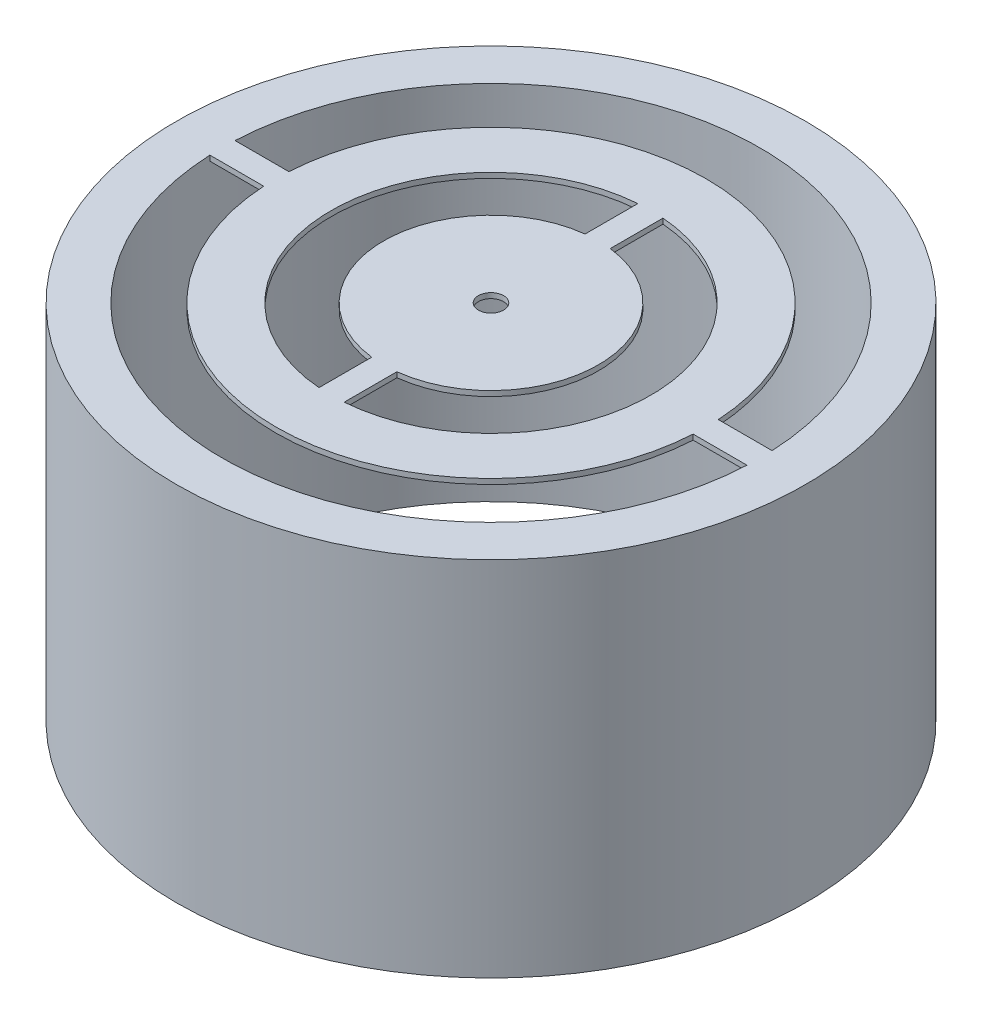
ISO-10303-21;
HEADER;
FILE_DESCRIPTION(('STEP AP214'),'2;1');
FILE_NAME('part.step','',(''),(''),'','','');
FILE_SCHEMA(('AUTOMOTIVE_DESIGN { 1 0 10303 214 1 1 1 1 }'));
ENDSEC;
DATA;
#1=APPLICATION_CONTEXT('core data for automotive mechanical design processes');
#2=APPLICATION_PROTOCOL_DEFINITION('international standard','automotive_design',2000,#1);
#3=PRODUCT_CONTEXT('',#1,'mechanical');
#4=PRODUCT('Part','Part','',(#3));
#5=PRODUCT_RELATED_PRODUCT_CATEGORY('part','',(#4));
#6=PRODUCT_DEFINITION_FORMATION('','',#4);
#7=PRODUCT_DEFINITION_CONTEXT('part definition',#1,'design');
#8=PRODUCT_DEFINITION('design','',#6,#7);
#9=PRODUCT_DEFINITION_SHAPE('','',#8);
#10=(LENGTH_UNIT() NAMED_UNIT(*) SI_UNIT(.MILLI.,.METRE.));
#11=(NAMED_UNIT(*) PLANE_ANGLE_UNIT() SI_UNIT($,.RADIAN.));
#12=(NAMED_UNIT(*) SI_UNIT($,.STERADIAN.) SOLID_ANGLE_UNIT());
#13=UNCERTAINTY_MEASURE_WITH_UNIT(LENGTH_MEASURE(1.E-05),#10,'distance_accuracy_value','');
#14=(GEOMETRIC_REPRESENTATION_CONTEXT(3) GLOBAL_UNCERTAINTY_ASSIGNED_CONTEXT((#13)) GLOBAL_UNIT_ASSIGNED_CONTEXT((#10,
#11,#12)) REPRESENTATION_CONTEXT('',''));
#15=CARTESIAN_POINT('',(0.,0.,0.));
#16=DIRECTION('',(0.,0.,1.));
#17=DIRECTION('',(1.,0.,0.));
#18=AXIS2_PLACEMENT_3D('',#15,#16,#17);
#19=CARTESIAN_POINT('',(0.,0.,0.));
#20=DIRECTION('',(0.,1.,0.));
#21=DIRECTION('',(0.,0.,1.));
#22=AXIS2_PLACEMENT_3D('',#19,#20,#21);
#23=PLANE('',#22);
#24=CARTESIAN_POINT('',(0.,0.,0.));
#25=DIRECTION('',(0.,1.,0.));
#26=DIRECTION('',(0.,0.,-1.));
#27=AXIS2_PLACEMENT_3D('',#24,#25,#26);
#28=CIRCLE('',#27,7.62386056946014);
#29=CARTESIAN_POINT('',(0.6,0.,7.60021381163511));
#30=VERTEX_POINT('',#29);
#31=CARTESIAN_POINT('',(0.6,0.,-7.60021381163511));
#32=VERTEX_POINT('',#31);
#33=EDGE_CURVE('E56',#30,#32,#28,.T.);
#34=ORIENTED_EDGE('',*,*,#33,.T.);
#35=DIRECTION('',(0.,0.,1.));
#36=VECTOR('',#35,1.);
#37=CARTESIAN_POINT('',(0.6,0.,-5.08496078060006));
#38=LINE('',#37,#36);
#39=CARTESIAN_POINT('',(0.6,0.,-5.08496078060006));
#40=VERTEX_POINT('',#39);
#41=EDGE_CURVE('E180',#32,#40,#38,.T.);
#42=ORIENTED_EDGE('',*,*,#41,.T.);
#43=CARTESIAN_POINT('',(0.,0.,0.));
#44=DIRECTION('',(0.,-1.,0.));
#45=DIRECTION('',(0.,0.,-1.));
#46=AXIS2_PLACEMENT_3D('',#43,#44,#45);
#47=CIRCLE('',#46,5.12023692227623);
#48=CARTESIAN_POINT('',(0.6,0.,5.08496078060006));
#49=VERTEX_POINT('',#48);
#50=EDGE_CURVE('E199',#40,#49,#47,.T.);
#51=ORIENTED_EDGE('',*,*,#50,.T.);
#52=DIRECTION('',(0.,0.,1.));
#53=VECTOR('',#52,1.);
#54=CARTESIAN_POINT('',(0.6,0.,5.08496078060006));
#55=LINE('',#54,#53);
#56=EDGE_CURVE('E190',#49,#30,#55,.T.);
#57=ORIENTED_EDGE('',*,*,#56,.T.);
#58=EDGE_LOOP('',(#34,#42,#51,#57));
#59=FACE_BOUND('',#58,.T.);
#60=CARTESIAN_POINT('',(0.,0.,0.));
#61=DIRECTION('',(0.,1.,0.));
#62=DIRECTION('',(0.,0.,1.));
#63=AXIS2_PLACEMENT_3D('',#60,#61,#62);
#64=CIRCLE('',#63,7.62386056946014);
#65=CARTESIAN_POINT('',(-0.6,0.,-7.60021381163511));
#66=VERTEX_POINT('',#65);
#67=CARTESIAN_POINT('',(-0.6,0.,7.60021381163511));
#68=VERTEX_POINT('',#67);
#69=EDGE_CURVE('E252',#66,#68,#64,.T.);
#70=ORIENTED_EDGE('',*,*,#69,.T.);
#71=DIRECTION('',(0.,0.,-1.));
#72=VECTOR('',#71,1.);
#73=CARTESIAN_POINT('',(-0.6,0.,7.60021381163511));
#74=LINE('',#73,#72);
#75=CARTESIAN_POINT('',(-0.6,0.,5.08496078060006));
#76=VERTEX_POINT('',#75);
#77=EDGE_CURVE('E268',#68,#76,#74,.T.);
#78=ORIENTED_EDGE('',*,*,#77,.T.);
#79=CARTESIAN_POINT('',(0.,0.,0.));
#80=DIRECTION('',(0.,-1.,0.));
#81=DIRECTION('',(0.,0.,1.));
#82=AXIS2_PLACEMENT_3D('',#79,#80,#81);
#83=CIRCLE('',#82,5.12023692227623);
#84=CARTESIAN_POINT('',(-0.6,0.,-5.08496078060006));
#85=VERTEX_POINT('',#84);
#86=EDGE_CURVE('E271',#76,#85,#83,.T.);
#87=ORIENTED_EDGE('',*,*,#86,.T.);
#88=DIRECTION('',(0.,0.,-1.));
#89=VECTOR('',#88,1.);
#90=CARTESIAN_POINT('',(-0.6,0.,-7.60021381163511));
#91=LINE('',#90,#89);
#92=EDGE_CURVE('E258',#85,#66,#91,.T.);
#93=ORIENTED_EDGE('',*,*,#92,.T.);
#94=EDGE_LOOP('',(#70,#78,#87,#93));
#95=FACE_BOUND('',#94,.T.);
#96=CARTESIAN_POINT('',(0.,0.,0.));
#97=DIRECTION('',(0.,1.,0.));
#98=DIRECTION('',(0.,0.,1.));
#99=AXIS2_PLACEMENT_3D('',#96,#97,#98);
#100=CIRCLE('',#99,0.6);
#101=CARTESIAN_POINT('',(0.,0.,0.6));
#102=VERTEX_POINT('',#101);
#103=EDGE_CURVE('E248',#102,#102,#100,.T.);
#104=ORIENTED_EDGE('',*,*,#103,.T.);
#105=EDGE_LOOP('',(#104));
#106=FACE_BOUND('',#105,.T.);
#107=CARTESIAN_POINT('',(0.,0.,0.));
#108=DIRECTION('',(0.,1.,0.));
#109=DIRECTION('',(0.,0.,1.));
#110=AXIS2_PLACEMENT_3D('',#107,#108,#109);
#111=CIRCLE('',#110,12.8157373427537);
#112=CARTESIAN_POINT('',(12.8016844062979,0.,0.6));
#113=VERTEX_POINT('',#112);
#114=CARTESIAN_POINT('',(12.8016844062979,0.,-0.6));
#115=VERTEX_POINT('',#114);
#116=EDGE_CURVE('E167',#113,#115,#111,.T.);
#117=ORIENTED_EDGE('',*,*,#116,.F.);
#118=DIRECTION('',(-1.,0.,0.));
#119=VECTOR('',#118,1.);
#120=CARTESIAN_POINT('',(10.2351825917073,0.,0.6));
#121=LINE('',#120,#119);
#122=CARTESIAN_POINT('',(10.2351825917073,0.,0.6));
#123=VERTEX_POINT('',#122);
#124=EDGE_CURVE('E148',#113,#123,#121,.T.);
#125=ORIENTED_EDGE('',*,*,#124,.T.);
#126=CARTESIAN_POINT('',(0.,0.,0.));
#127=DIRECTION('',(0.,-1.,0.));
#128=DIRECTION('',(0.,0.,1.));
#129=AXIS2_PLACEMENT_3D('',#126,#127,#128);
#130=CIRCLE('',#129,10.2527539073943);
#131=CARTESIAN_POINT('',(-10.2351825917073,0.,0.6));
#132=VERTEX_POINT('',#131);
#133=EDGE_CURVE('E210',#123,#132,#130,.T.);
#134=ORIENTED_EDGE('',*,*,#133,.T.);
#135=DIRECTION('',(-1.,0.,0.));
#136=VECTOR('',#135,1.);
#137=CARTESIAN_POINT('',(-12.8016844062979,0.,0.6));
#138=LINE('',#137,#136);
#139=CARTESIAN_POINT('',(-12.8016844062979,0.,0.6));
#140=VERTEX_POINT('',#139);
#141=EDGE_CURVE('E159',#132,#140,#138,.T.);
#142=ORIENTED_EDGE('',*,*,#141,.T.);
#143=CARTESIAN_POINT('',(-12.8016844062979,0.,-0.6));
#144=VERTEX_POINT('',#143);
#145=EDGE_CURVE('E178',#144,#140,#111,.T.);
#146=ORIENTED_EDGE('',*,*,#145,.F.);
#147=DIRECTION('',(1.,0.,0.));
#148=VECTOR('',#147,1.);
#149=CARTESIAN_POINT('',(-12.8016844062979,0.,-0.6));
#150=LINE('',#149,#148);
#151=CARTESIAN_POINT('',(-10.2351825917073,0.,-0.599999999999996));
#152=VERTEX_POINT('',#151);
#153=EDGE_CURVE('E225',#144,#152,#150,.T.);
#154=ORIENTED_EDGE('',*,*,#153,.T.);
#155=CARTESIAN_POINT('',(0.,0.,0.));
#156=DIRECTION('',(0.,-1.,0.));
#157=DIRECTION('',(0.,0.,-1.));
#158=AXIS2_PLACEMENT_3D('',#155,#156,#157);
#159=CIRCLE('',#158,10.2527539073943);
#160=CARTESIAN_POINT('',(10.2351825917073,0.,-0.6));
#161=VERTEX_POINT('',#160);
#162=EDGE_CURVE('E238',#152,#161,#159,.T.);
#163=ORIENTED_EDGE('',*,*,#162,.T.);
#164=DIRECTION('',(1.,0.,0.));
#165=VECTOR('',#164,1.);
#166=CARTESIAN_POINT('',(10.2351825917073,0.,-0.6));
#167=LINE('',#166,#165);
#168=EDGE_CURVE('E177',#161,#115,#167,.T.);
#169=ORIENTED_EDGE('',*,*,#168,.T.);
#170=EDGE_LOOP('',(#117,#125,#134,#142,#146,#154,#163,#169));
#171=FACE_BOUND('',#170,.T.);
#172=ADVANCED_FACE('F33',(#59,#95,#106,#171),#23,.F.);
#173=CARTESIAN_POINT('',(0.,0.25,0.));
#174=DIRECTION('',(0.,1.,0.));
#175=DIRECTION('',(0.,0.,1.));
#176=AXIS2_PLACEMENT_3D('',#173,#174,#175);
#177=PLANE('',#176);
#178=CARTESIAN_POINT('',(0.,0.25,0.));
#179=DIRECTION('',(0.,1.,0.));
#180=DIRECTION('',(0.,0.,-1.));
#181=AXIS2_PLACEMENT_3D('',#178,#179,#180);
#182=CIRCLE('',#181,12.8157373427537);
#183=CARTESIAN_POINT('',(12.8016844062979,0.25,-0.6));
#184=VERTEX_POINT('',#183);
#185=CARTESIAN_POINT('',(-12.8016844062979,0.25,-0.6));
#186=VERTEX_POINT('',#185);
#187=EDGE_CURVE('E226',#184,#186,#182,.T.);
#188=ORIENTED_EDGE('',*,*,#187,.F.);
#189=DIRECTION('',(1.,0.,0.));
#190=VECTOR('',#189,1.);
#191=CARTESIAN_POINT('',(10.2351825917073,0.25,-0.6));
#192=LINE('',#191,#190);
#193=CARTESIAN_POINT('',(10.2351825917073,0.25,-0.6));
#194=VERTEX_POINT('',#193);
#195=EDGE_CURVE('E233',#194,#184,#192,.T.);
#196=ORIENTED_EDGE('',*,*,#195,.F.);
#197=CARTESIAN_POINT('',(0.,0.25,0.));
#198=DIRECTION('',(0.,-1.,0.));
#199=DIRECTION('',(0.,0.,-1.));
#200=AXIS2_PLACEMENT_3D('',#197,#198,#199);
#201=CIRCLE('',#200,10.2527539073943);
#202=CARTESIAN_POINT('',(-10.2351825917073,0.25,-0.599999999999996));
#203=VERTEX_POINT('',#202);
#204=EDGE_CURVE('E230',#203,#194,#201,.T.);
#205=ORIENTED_EDGE('',*,*,#204,.F.);
#206=DIRECTION('',(1.,0.,0.));
#207=VECTOR('',#206,1.);
#208=CARTESIAN_POINT('',(-12.8016844062979,0.25,-0.6));
#209=LINE('',#208,#207);
#210=EDGE_CURVE('E228',#186,#203,#209,.T.);
#211=ORIENTED_EDGE('',*,*,#210,.F.);
#212=EDGE_LOOP('',(#188,#196,#205,#211));
#213=FACE_BOUND('',#212,.T.);
#214=DIRECTION('',(-1.,0.,0.));
#215=VECTOR('',#214,1.);
#216=CARTESIAN_POINT('',(10.2351825917073,0.25,0.6));
#217=LINE('',#216,#215);
#218=CARTESIAN_POINT('',(12.8016844062979,0.25,0.6));
#219=VERTEX_POINT('',#218);
#220=CARTESIAN_POINT('',(10.2351825917073,0.25,0.6));
#221=VERTEX_POINT('',#220);
#222=EDGE_CURVE('E215',#219,#221,#217,.T.);
#223=ORIENTED_EDGE('',*,*,#222,.F.);
#224=CARTESIAN_POINT('',(0.,0.25,0.));
#225=DIRECTION('',(0.,1.,0.));
#226=DIRECTION('',(0.,0.,1.));
#227=AXIS2_PLACEMENT_3D('',#224,#225,#226);
#228=CIRCLE('',#227,12.8157373427537);
#229=CARTESIAN_POINT('',(-12.8016844062979,0.25,0.6));
#230=VERTEX_POINT('',#229);
#231=EDGE_CURVE('E170',#230,#219,#228,.T.);
#232=ORIENTED_EDGE('',*,*,#231,.F.);
#233=DIRECTION('',(-1.,0.,0.));
#234=VECTOR('',#233,1.);
#235=CARTESIAN_POINT('',(-12.8016844062979,0.25,0.6));
#236=LINE('',#235,#234);
#237=CARTESIAN_POINT('',(-10.2351825917073,0.25,0.6));
#238=VERTEX_POINT('',#237);
#239=EDGE_CURVE('E212',#238,#230,#236,.T.);
#240=ORIENTED_EDGE('',*,*,#239,.F.);
#241=CARTESIAN_POINT('',(0.,0.25,0.));
#242=DIRECTION('',(0.,-1.,0.));
#243=DIRECTION('',(0.,0.,1.));
#244=AXIS2_PLACEMENT_3D('',#241,#242,#243);
#245=CIRCLE('',#244,10.2527539073943);
#246=EDGE_CURVE('E158',#221,#238,#245,.T.);
#247=ORIENTED_EDGE('',*,*,#246,.F.);
#248=EDGE_LOOP('',(#223,#232,#240,#247));
#249=FACE_BOUND('',#248,.T.);
#250=CARTESIAN_POINT('',(0.,0.25,0.));
#251=DIRECTION('',(0.,1.,0.));
#252=DIRECTION('',(0.,0.,1.));
#253=AXIS2_PLACEMENT_3D('',#250,#251,#252);
#254=CIRCLE('',#253,15.);
#255=CARTESIAN_POINT('',(0.,0.25,15.));
#256=VERTEX_POINT('',#255);
#257=EDGE_CURVE('E11',#256,#256,#254,.T.);
#258=ORIENTED_EDGE('',*,*,#257,.T.);
#259=EDGE_LOOP('',(#258));
#260=FACE_BOUND('',#259,.T.);
#261=DIRECTION('',(0.,0.,1.));
#262=VECTOR('',#261,1.);
#263=CARTESIAN_POINT('',(0.6,0.25,-5.08496078060006));
#264=LINE('',#263,#262);
#265=CARTESIAN_POINT('',(0.6,0.25,-7.60021381163511));
#266=VERTEX_POINT('',#265);
#267=CARTESIAN_POINT('',(0.6,0.25,-5.08496078060006));
#268=VERTEX_POINT('',#267);
#269=EDGE_CURVE('E189',#266,#268,#264,.T.);
#270=ORIENTED_EDGE('',*,*,#269,.F.);
#271=CARTESIAN_POINT('',(0.,0.25,0.));
#272=DIRECTION('',(0.,1.,0.));
#273=DIRECTION('',(0.,0.,-1.));
#274=AXIS2_PLACEMENT_3D('',#271,#272,#273);
#275=CIRCLE('',#274,7.62386056946014);
#276=CARTESIAN_POINT('',(0.6,0.25,7.60021381163511));
#277=VERTEX_POINT('',#276);
#278=EDGE_CURVE('E187',#277,#266,#275,.T.);
#279=ORIENTED_EDGE('',*,*,#278,.F.);
#280=DIRECTION('',(0.,0.,1.));
#281=VECTOR('',#280,1.);
#282=CARTESIAN_POINT('',(0.6,0.25,5.08496078060006));
#283=LINE('',#282,#281);
#284=CARTESIAN_POINT('',(0.6,0.25,5.08496078060006));
#285=VERTEX_POINT('',#284);
#286=EDGE_CURVE('E194',#285,#277,#283,.T.);
#287=ORIENTED_EDGE('',*,*,#286,.F.);
#288=CARTESIAN_POINT('',(0.,0.25,0.));
#289=DIRECTION('',(0.,-1.,0.));
#290=DIRECTION('',(0.,0.,-1.));
#291=AXIS2_PLACEMENT_3D('',#288,#289,#290);
#292=CIRCLE('',#291,5.12023692227623);
#293=EDGE_CURVE('E192',#268,#285,#292,.T.);
#294=ORIENTED_EDGE('',*,*,#293,.F.);
#295=EDGE_LOOP('',(#270,#279,#287,#294));
#296=FACE_BOUND('',#295,.T.);
#297=CARTESIAN_POINT('',(0.,0.25,0.));
#298=DIRECTION('',(0.,1.,0.));
#299=DIRECTION('',(0.,0.,1.));
#300=AXIS2_PLACEMENT_3D('',#297,#298,#299);
#301=CIRCLE('',#300,0.6);
#302=CARTESIAN_POINT('',(0.,0.25,0.6));
#303=VERTEX_POINT('',#302);
#304=EDGE_CURVE('E249',#303,#303,#301,.T.);
#305=ORIENTED_EDGE('',*,*,#304,.F.);
#306=EDGE_LOOP('',(#305));
#307=FACE_BOUND('',#306,.T.);
#308=DIRECTION('',(0.,0.,-1.));
#309=VECTOR('',#308,1.);
#310=CARTESIAN_POINT('',(-0.6,0.25,7.60021381163511));
#311=LINE('',#310,#309);
#312=CARTESIAN_POINT('',(-0.6,0.25,7.60021381163511));
#313=VERTEX_POINT('',#312);
#314=CARTESIAN_POINT('',(-0.6,0.25,5.08496078060006));
#315=VERTEX_POINT('',#314);
#316=EDGE_CURVE('E257',#313,#315,#311,.T.);
#317=ORIENTED_EDGE('',*,*,#316,.F.);
#318=CARTESIAN_POINT('',(0.,0.25,0.));
#319=DIRECTION('',(0.,1.,0.));
#320=DIRECTION('',(0.,0.,1.));
#321=AXIS2_PLACEMENT_3D('',#318,#319,#320);
#322=CIRCLE('',#321,7.62386056946014);
#323=CARTESIAN_POINT('',(-0.6,0.25,-7.60021381163511));
#324=VERTEX_POINT('',#323);
#325=EDGE_CURVE('E255',#324,#313,#322,.T.);
#326=ORIENTED_EDGE('',*,*,#325,.F.);
#327=DIRECTION('',(0.,0.,-1.));
#328=VECTOR('',#327,1.);
#329=CARTESIAN_POINT('',(-0.6,0.25,-7.60021381163511));
#330=LINE('',#329,#328);
#331=CARTESIAN_POINT('',(-0.6,0.25,-5.08496078060006));
#332=VERTEX_POINT('',#331);
#333=EDGE_CURVE('E263',#332,#324,#330,.T.);
#334=ORIENTED_EDGE('',*,*,#333,.F.);
#335=CARTESIAN_POINT('',(0.,0.25,0.));
#336=DIRECTION('',(0.,-1.,0.));
#337=DIRECTION('',(0.,0.,1.));
#338=AXIS2_PLACEMENT_3D('',#335,#336,#337);
#339=CIRCLE('',#338,5.12023692227623);
#340=EDGE_CURVE('E260',#315,#332,#339,.T.);
#341=ORIENTED_EDGE('',*,*,#340,.F.);
#342=EDGE_LOOP('',(#317,#326,#334,#341));
#343=FACE_BOUND('',#342,.T.);
#344=ADVANCED_FACE('F297',(#213,#249,#260,#296,#307,#343),#177,.T.);
#345=CARTESIAN_POINT('',(0.,0.25,0.));
#346=DIRECTION('',(0.,-1.,0.));
#347=DIRECTION('',(0.,0.,-1.));
#348=AXIS2_PLACEMENT_3D('',#345,#346,#347);
#349=CYLINDRICAL_SURFACE('',#348,15.);
#350=ORIENTED_EDGE('',*,*,#257,.F.);
#351=EDGE_LOOP('',(#350));
#352=FACE_BOUND('',#351,.T.);
#353=CARTESIAN_POINT('',(0.,-17.018,0.));
#354=DIRECTION('',(0.,1.,0.));
#355=DIRECTION('',(0.,0.,1.));
#356=AXIS2_PLACEMENT_3D('',#353,#354,#355);
#357=CIRCLE('',#356,15.);
#358=CARTESIAN_POINT('',(0.,-17.018,15.));
#359=VERTEX_POINT('',#358);
#360=EDGE_CURVE('E183',#359,#359,#357,.T.);
#361=ORIENTED_EDGE('',*,*,#360,.T.);
#362=EDGE_LOOP('',(#361));
#363=FACE_BOUND('',#362,.T.);
#364=ADVANCED_FACE('F35',(#352,#363),#349,.T.);
#365=CARTESIAN_POINT('',(0.,0.25,0.));
#366=DIRECTION('',(0.,-1.,0.));
#367=DIRECTION('',(0.,0.,-1.));
#368=AXIS2_PLACEMENT_3D('',#365,#366,#367);
#369=CYLINDRICAL_SURFACE('',#368,7.62386056946014);
#370=ORIENTED_EDGE('',*,*,#69,.F.);
#371=DIRECTION('',(0.,-1.,0.));
#372=VECTOR('',#371,1.);
#373=CARTESIAN_POINT('',(-0.6,0.25,-7.60021381163511));
#374=LINE('',#373,#372);
#375=EDGE_CURVE('E265',#324,#66,#374,.T.);
#376=ORIENTED_EDGE('',*,*,#375,.F.);
#377=ORIENTED_EDGE('',*,*,#325,.T.);
#378=DIRECTION('',(0.,-1.,0.));
#379=VECTOR('',#378,1.);
#380=CARTESIAN_POINT('',(-0.6,0.25,7.60021381163511));
#381=LINE('',#380,#379);
#382=EDGE_CURVE('E41',#313,#68,#381,.T.);
#383=ORIENTED_EDGE('',*,*,#382,.T.);
#384=EDGE_LOOP('',(#370,#376,#377,#383));
#385=FACE_BOUND('',#384,.T.);
#386=ADVANCED_FACE('F284',(#385),#369,.F.);
#387=CARTESIAN_POINT('',(-0.6,0.25,7.60021381163511));
#388=DIRECTION('',(-1.,0.,0.));
#389=DIRECTION('',(0.,0.,1.));
#390=AXIS2_PLACEMENT_3D('',#387,#388,#389);
#391=PLANE('',#390);
#392=ORIENTED_EDGE('',*,*,#77,.F.);
#393=ORIENTED_EDGE('',*,*,#382,.F.);
#394=ORIENTED_EDGE('',*,*,#316,.T.);
#395=DIRECTION('',(0.,-1.,0.));
#396=VECTOR('',#395,1.);
#397=CARTESIAN_POINT('',(-0.6,0.25,5.08496078060006));
#398=LINE('',#397,#396);
#399=EDGE_CURVE('E280',#315,#76,#398,.T.);
#400=ORIENTED_EDGE('',*,*,#399,.T.);
#401=EDGE_LOOP('',(#392,#393,#394,#400));
#402=FACE_BOUND('',#401,.T.);
#403=ADVANCED_FACE('F300',(#402),#391,.T.);
#404=CARTESIAN_POINT('',(0.,0.25,0.));
#405=DIRECTION('',(0.,-1.,0.));
#406=DIRECTION('',(0.,0.,-1.));
#407=AXIS2_PLACEMENT_3D('',#404,#405,#406);
#408=CYLINDRICAL_SURFACE('',#407,5.12023692227623);
#409=ORIENTED_EDGE('',*,*,#86,.F.);
#410=ORIENTED_EDGE('',*,*,#399,.F.);
#411=ORIENTED_EDGE('',*,*,#340,.T.);
#412=DIRECTION('',(0.,-1.,0.));
#413=VECTOR('',#412,1.);
#414=CARTESIAN_POINT('',(-0.6,0.25,-5.08496078060006));
#415=LINE('',#414,#413);
#416=EDGE_CURVE('E278',#332,#85,#415,.T.);
#417=ORIENTED_EDGE('',*,*,#416,.T.);
#418=EDGE_LOOP('',(#409,#410,#411,#417));
#419=FACE_BOUND('',#418,.T.);
#420=ADVANCED_FACE('F302',(#419),#408,.T.);
#421=CARTESIAN_POINT('',(-0.6,0.25,-7.60021381163511));
#422=DIRECTION('',(-1.,0.,0.));
#423=DIRECTION('',(0.,0.,1.));
#424=AXIS2_PLACEMENT_3D('',#421,#422,#423);
#425=PLANE('',#424);
#426=ORIENTED_EDGE('',*,*,#92,.F.);
#427=ORIENTED_EDGE('',*,*,#416,.F.);
#428=ORIENTED_EDGE('',*,*,#333,.T.);
#429=ORIENTED_EDGE('',*,*,#375,.T.);
#430=EDGE_LOOP('',(#426,#427,#428,#429));
#431=FACE_BOUND('',#430,.T.);
#432=ADVANCED_FACE('F294',(#431),#425,.T.);
#433=CARTESIAN_POINT('',(0.,0.25,0.));
#434=DIRECTION('',(0.,-1.,0.));
#435=DIRECTION('',(0.,0.,-1.));
#436=AXIS2_PLACEMENT_3D('',#433,#434,#435);
#437=CYLINDRICAL_SURFACE('',#436,0.6);
#438=ORIENTED_EDGE('',*,*,#304,.T.);
#439=EDGE_LOOP('',(#438));
#440=FACE_BOUND('',#439,.T.);
#441=ORIENTED_EDGE('',*,*,#103,.F.);
#442=EDGE_LOOP('',(#441));
#443=FACE_BOUND('',#442,.T.);
#444=ADVANCED_FACE('F309',(#440,#443),#437,.F.);
#445=CARTESIAN_POINT('',(0.,0.25,0.));
#446=DIRECTION('',(0.,-1.,0.));
#447=DIRECTION('',(0.,0.,-1.));
#448=AXIS2_PLACEMENT_3D('',#445,#446,#447);
#449=CYLINDRICAL_SURFACE('',#448,12.8157373427537);
#450=DIRECTION('',(0.,-1.,0.));
#451=VECTOR('',#450,1.);
#452=CARTESIAN_POINT('',(-12.8016844062979,0.25,-0.6));
#453=LINE('',#452,#451);
#454=EDGE_CURVE('E246',#186,#144,#453,.T.);
#455=ORIENTED_EDGE('',*,*,#454,.T.);
#456=ORIENTED_EDGE('',*,*,#145,.T.);
#457=DIRECTION('',(0.,-1.,0.));
#458=VECTOR('',#457,1.);
#459=CARTESIAN_POINT('',(-12.8016844062979,0.25,0.6));
#460=LINE('',#459,#458);
#461=EDGE_CURVE('E172',#230,#140,#460,.T.);
#462=ORIENTED_EDGE('',*,*,#461,.F.);
#463=ORIENTED_EDGE('',*,*,#231,.T.);
#464=DIRECTION('',(0.,-1.,0.));
#465=VECTOR('',#464,1.);
#466=CARTESIAN_POINT('',(12.8016844062979,0.25,0.599999999999994));
#467=LINE('',#466,#465);
#468=EDGE_CURVE('E151',#219,#113,#467,.T.);
#469=ORIENTED_EDGE('',*,*,#468,.T.);
#470=ORIENTED_EDGE('',*,*,#116,.T.);
#471=DIRECTION('',(0.,-1.,0.));
#472=VECTOR('',#471,1.);
#473=CARTESIAN_POINT('',(12.8016844062979,0.25,-0.6));
#474=LINE('',#473,#472);
#475=EDGE_CURVE('E235',#184,#115,#474,.T.);
#476=ORIENTED_EDGE('',*,*,#475,.F.);
#477=ORIENTED_EDGE('',*,*,#187,.T.);
#478=EDGE_LOOP('',(#455,#456,#462,#463,#469,#470,#476,#477));
#479=FACE_BOUND('',#478,.T.);
#480=CARTESIAN_POINT('',(0.,-17.018,0.));
#481=DIRECTION('',(0.,1.,0.));
#482=DIRECTION('',(0.,0.,1.));
#483=AXIS2_PLACEMENT_3D('',#480,#481,#482);
#484=CIRCLE('',#483,12.8157373427537);
#485=CARTESIAN_POINT('',(0.,-17.018,12.8157373427537));
#486=VERTEX_POINT('',#485);
#487=EDGE_CURVE('E332',#486,#486,#484,.T.);
#488=ORIENTED_EDGE('',*,*,#487,.F.);
#489=EDGE_LOOP('',(#488));
#490=FACE_BOUND('',#489,.T.);
#491=ADVANCED_FACE('F164',(#479,#490),#449,.F.);
#492=CARTESIAN_POINT('',(-12.8016844062979,0.25,-0.6));
#493=DIRECTION('',(0.,0.,-1.));
#494=DIRECTION('',(-1.,0.,0.));
#495=AXIS2_PLACEMENT_3D('',#492,#493,#494);
#496=PLANE('',#495);
#497=ORIENTED_EDGE('',*,*,#153,.F.);
#498=ORIENTED_EDGE('',*,*,#454,.F.);
#499=ORIENTED_EDGE('',*,*,#210,.T.);
#500=DIRECTION('',(0.,-1.,0.));
#501=VECTOR('',#500,1.);
#502=CARTESIAN_POINT('',(-10.2351825917073,0.25,-0.599999999999996));
#503=LINE('',#502,#501);
#504=EDGE_CURVE('E244',#203,#152,#503,.T.);
#505=ORIENTED_EDGE('',*,*,#504,.T.);
#506=EDGE_LOOP('',(#497,#498,#499,#505));
#507=FACE_BOUND('',#506,.T.);
#508=ADVANCED_FACE('F338',(#507),#496,.T.);
#509=CARTESIAN_POINT('',(0.,0.25,0.));
#510=DIRECTION('',(0.,-1.,0.));
#511=DIRECTION('',(0.,0.,-1.));
#512=AXIS2_PLACEMENT_3D('',#509,#510,#511);
#513=CYLINDRICAL_SURFACE('',#512,10.2527539073943);
#514=ORIENTED_EDGE('',*,*,#162,.F.);
#515=ORIENTED_EDGE('',*,*,#504,.F.);
#516=ORIENTED_EDGE('',*,*,#204,.T.);
#517=DIRECTION('',(0.,-1.,0.));
#518=VECTOR('',#517,1.);
#519=CARTESIAN_POINT('',(10.2351825917073,0.25,-0.6));
#520=LINE('',#519,#518);
#521=EDGE_CURVE('E242',#194,#161,#520,.T.);
#522=ORIENTED_EDGE('',*,*,#521,.T.);
#523=EDGE_LOOP('',(#514,#515,#516,#522));
#524=FACE_BOUND('',#523,.T.);
#525=ADVANCED_FACE('F344',(#524),#513,.T.);
#526=CARTESIAN_POINT('',(10.2351825917073,0.25,-0.6));
#527=DIRECTION('',(0.,0.,-1.));
#528=DIRECTION('',(-1.,0.,0.));
#529=AXIS2_PLACEMENT_3D('',#526,#527,#528);
#530=PLANE('',#529);
#531=ORIENTED_EDGE('',*,*,#168,.F.);
#532=ORIENTED_EDGE('',*,*,#521,.F.);
#533=ORIENTED_EDGE('',*,*,#195,.T.);
#534=ORIENTED_EDGE('',*,*,#475,.T.);
#535=EDGE_LOOP('',(#531,#532,#533,#534));
#536=FACE_BOUND('',#535,.T.);
#537=ADVANCED_FACE('F352',(#536),#530,.T.);
#538=CARTESIAN_POINT('',(0.,0.25,0.));
#539=DIRECTION('',(0.,-1.,0.));
#540=DIRECTION('',(0.,0.,-1.));
#541=AXIS2_PLACEMENT_3D('',#538,#539,#540);
#542=CYLINDRICAL_SURFACE('',#541,10.2527539073943);
#543=ORIENTED_EDGE('',*,*,#133,.F.);
#544=DIRECTION('',(0.,-1.,0.));
#545=VECTOR('',#544,1.);
#546=CARTESIAN_POINT('',(10.2351825917073,0.25,0.6));
#547=LINE('',#546,#545);
#548=EDGE_CURVE('E154',#221,#123,#547,.T.);
#549=ORIENTED_EDGE('',*,*,#548,.F.);
#550=ORIENTED_EDGE('',*,*,#246,.T.);
#551=DIRECTION('',(0.,-1.,0.));
#552=VECTOR('',#551,1.);
#553=CARTESIAN_POINT('',(-10.2351825917073,0.25,0.6));
#554=LINE('',#553,#552);
#555=EDGE_CURVE('E222',#238,#132,#554,.T.);
#556=ORIENTED_EDGE('',*,*,#555,.T.);
#557=EDGE_LOOP('',(#543,#549,#550,#556));
#558=FACE_BOUND('',#557,.T.);
#559=ADVANCED_FACE('F356',(#558),#542,.T.);
#560=CARTESIAN_POINT('',(-12.8016844062979,0.25,0.6));
#561=DIRECTION('',(0.,0.,1.));
#562=DIRECTION('',(1.,0.,0.));
#563=AXIS2_PLACEMENT_3D('',#560,#561,#562);
#564=PLANE('',#563);
#565=ORIENTED_EDGE('',*,*,#141,.F.);
#566=ORIENTED_EDGE('',*,*,#555,.F.);
#567=ORIENTED_EDGE('',*,*,#239,.T.);
#568=ORIENTED_EDGE('',*,*,#461,.T.);
#569=EDGE_LOOP('',(#565,#566,#567,#568));
#570=FACE_BOUND('',#569,.T.);
#571=ADVANCED_FACE('F360',(#570),#564,.T.);
#572=CARTESIAN_POINT('',(10.2351825917073,0.25,0.6));
#573=DIRECTION('',(0.,0.,1.));
#574=DIRECTION('',(1.,0.,0.));
#575=AXIS2_PLACEMENT_3D('',#572,#573,#574);
#576=PLANE('',#575);
#577=ORIENTED_EDGE('',*,*,#124,.F.);
#578=ORIENTED_EDGE('',*,*,#468,.F.);
#579=ORIENTED_EDGE('',*,*,#222,.T.);
#580=ORIENTED_EDGE('',*,*,#548,.T.);
#581=EDGE_LOOP('',(#577,#578,#579,#580));
#582=FACE_BOUND('',#581,.T.);
#583=ADVANCED_FACE('F150',(#582),#576,.T.);
#584=CARTESIAN_POINT('',(0.,0.25,0.));
#585=DIRECTION('',(0.,-1.,0.));
#586=DIRECTION('',(0.,0.,-1.));
#587=AXIS2_PLACEMENT_3D('',#584,#585,#586);
#588=CYLINDRICAL_SURFACE('',#587,7.62386056946014);
#589=ORIENTED_EDGE('',*,*,#33,.F.);
#590=DIRECTION('',(0.,-1.,0.));
#591=VECTOR('',#590,1.);
#592=CARTESIAN_POINT('',(0.6,0.25,7.60021381163511));
#593=LINE('',#592,#591);
#594=EDGE_CURVE('E195',#277,#30,#593,.T.);
#595=ORIENTED_EDGE('',*,*,#594,.F.);
#596=ORIENTED_EDGE('',*,*,#278,.T.);
#597=DIRECTION('',(0.,-1.,0.));
#598=VECTOR('',#597,1.);
#599=CARTESIAN_POINT('',(0.6,0.25,-7.60021381163511));
#600=LINE('',#599,#598);
#601=EDGE_CURVE('E208',#266,#32,#600,.T.);
#602=ORIENTED_EDGE('',*,*,#601,.T.);
#603=EDGE_LOOP('',(#589,#595,#596,#602));
#604=FACE_BOUND('',#603,.T.);
#605=ADVANCED_FACE('F367',(#604),#588,.F.);
#606=CARTESIAN_POINT('',(0.6,0.25,-5.08496078060006));
#607=DIRECTION('',(1.,0.,0.));
#608=DIRECTION('',(0.,0.,-1.));
#609=AXIS2_PLACEMENT_3D('',#606,#607,#608);
#610=PLANE('',#609);
#611=ORIENTED_EDGE('',*,*,#41,.F.);
#612=ORIENTED_EDGE('',*,*,#601,.F.);
#613=ORIENTED_EDGE('',*,*,#269,.T.);
#614=DIRECTION('',(0.,-1.,0.));
#615=VECTOR('',#614,1.);
#616=CARTESIAN_POINT('',(0.6,0.25,-5.08496078060006));
#617=LINE('',#616,#615);
#618=EDGE_CURVE('E206',#268,#40,#617,.T.);
#619=ORIENTED_EDGE('',*,*,#618,.T.);
#620=EDGE_LOOP('',(#611,#612,#613,#619));
#621=FACE_BOUND('',#620,.T.);
#622=ADVANCED_FACE('F370',(#621),#610,.T.);
#623=CARTESIAN_POINT('',(0.,0.25,0.));
#624=DIRECTION('',(0.,-1.,0.));
#625=DIRECTION('',(0.,0.,-1.));
#626=AXIS2_PLACEMENT_3D('',#623,#624,#625);
#627=CYLINDRICAL_SURFACE('',#626,5.12023692227623);
#628=ORIENTED_EDGE('',*,*,#50,.F.);
#629=ORIENTED_EDGE('',*,*,#618,.F.);
#630=ORIENTED_EDGE('',*,*,#293,.T.);
#631=DIRECTION('',(0.,-1.,0.));
#632=VECTOR('',#631,1.);
#633=CARTESIAN_POINT('',(0.6,0.25,5.08496078060006));
#634=LINE('',#633,#632);
#635=EDGE_CURVE('E48',#285,#49,#634,.T.);
#636=ORIENTED_EDGE('',*,*,#635,.T.);
#637=EDGE_LOOP('',(#628,#629,#630,#636));
#638=FACE_BOUND('',#637,.T.);
#639=ADVANCED_FACE('F373',(#638),#627,.T.);
#640=CARTESIAN_POINT('',(0.6,0.25,5.08496078060006));
#641=DIRECTION('',(1.,0.,0.));
#642=DIRECTION('',(0.,0.,-1.));
#643=AXIS2_PLACEMENT_3D('',#640,#641,#642);
#644=PLANE('',#643);
#645=ORIENTED_EDGE('',*,*,#56,.F.);
#646=ORIENTED_EDGE('',*,*,#635,.F.);
#647=ORIENTED_EDGE('',*,*,#286,.T.);
#648=ORIENTED_EDGE('',*,*,#594,.T.);
#649=EDGE_LOOP('',(#645,#646,#647,#648));
#650=FACE_BOUND('',#649,.T.);
#651=ADVANCED_FACE('F377',(#650),#644,.T.);
#652=CARTESIAN_POINT('',(0.,-17.018,0.));
#653=DIRECTION('',(0.,1.,0.));
#654=DIRECTION('',(0.,0.,1.));
#655=AXIS2_PLACEMENT_3D('',#652,#653,#654);
#656=PLANE('',#655);
#657=ORIENTED_EDGE('',*,*,#487,.T.);
#658=EDGE_LOOP('',(#657));
#659=FACE_BOUND('',#658,.T.);
#660=ORIENTED_EDGE('',*,*,#360,.F.);
#661=EDGE_LOOP('',(#660));
#662=FACE_BOUND('',#661,.T.);
#663=ADVANCED_FACE('F336',(#659,#662),#656,.F.);
#664=CLOSED_SHELL('',(#172,#344,#364,#386,#403,#420,#432,#444,#491,#508,#525,#537,#559,#571,
#583,#605,#622,#639,#651,#663));
#665=MANIFOLD_SOLID_BREP('B2',#664);
#666=ADVANCED_BREP_SHAPE_REPRESENTATION('',(#18,#665),#14);
#667=SHAPE_DEFINITION_REPRESENTATION(#9,#666);
ENDSEC;
END-ISO-10303-21;
